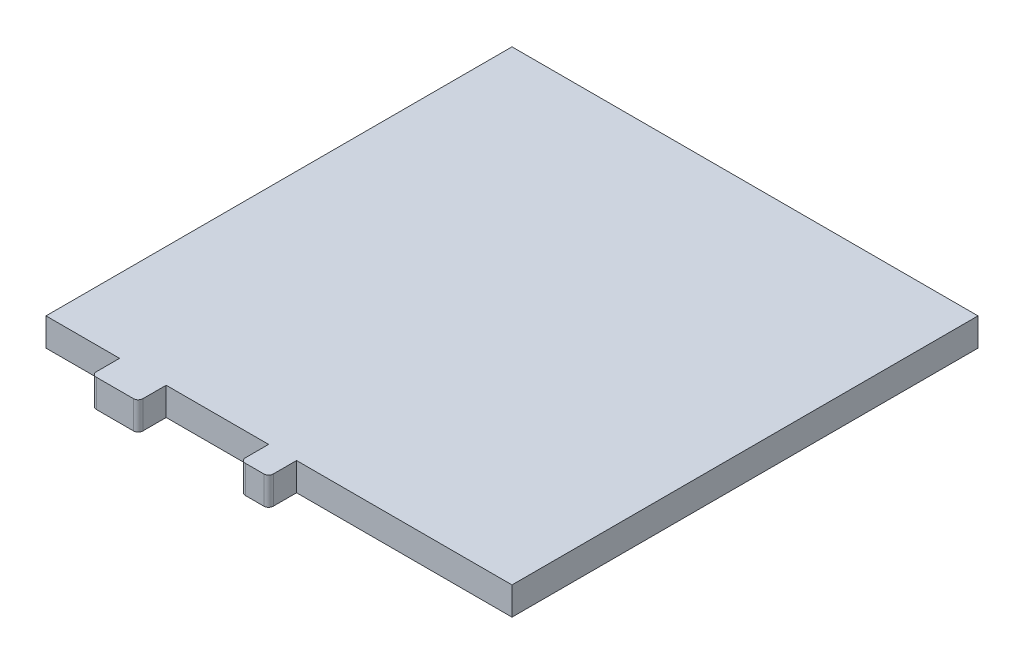
ISO-10303-21;
HEADER;
FILE_DESCRIPTION(('STEP AP214'),'2;1');
FILE_NAME('part.step','',(''),(''),'','','');
FILE_SCHEMA(('AUTOMOTIVE_DESIGN { 1 0 10303 214 1 1 1 1 }'));
ENDSEC;
DATA;
#1=APPLICATION_CONTEXT('core data for automotive mechanical design processes');
#2=APPLICATION_PROTOCOL_DEFINITION('international standard','automotive_design',2000,#1);
#3=PRODUCT_CONTEXT('',#1,'mechanical');
#4=PRODUCT('Part','Part','',(#3));
#5=PRODUCT_RELATED_PRODUCT_CATEGORY('part','',(#4));
#6=PRODUCT_DEFINITION_FORMATION('','',#4);
#7=PRODUCT_DEFINITION_CONTEXT('part definition',#1,'design');
#8=PRODUCT_DEFINITION('design','',#6,#7);
#9=PRODUCT_DEFINITION_SHAPE('','',#8);
#10=(LENGTH_UNIT() NAMED_UNIT(*) SI_UNIT(.MILLI.,.METRE.));
#11=(NAMED_UNIT(*) PLANE_ANGLE_UNIT() SI_UNIT($,.RADIAN.));
#12=(NAMED_UNIT(*) SI_UNIT($,.STERADIAN.) SOLID_ANGLE_UNIT());
#13=UNCERTAINTY_MEASURE_WITH_UNIT(LENGTH_MEASURE(1.E-05),#10,'distance_accuracy_value','');
#14=(GEOMETRIC_REPRESENTATION_CONTEXT(3) GLOBAL_UNCERTAINTY_ASSIGNED_CONTEXT((#13)) GLOBAL_UNIT_ASSIGNED_CONTEXT((#10,
#11,#12)) REPRESENTATION_CONTEXT('',''));
#15=CARTESIAN_POINT('',(0.,0.,0.));
#16=DIRECTION('',(0.,0.,1.));
#17=DIRECTION('',(1.,0.,0.));
#18=AXIS2_PLACEMENT_3D('',#15,#16,#17);
#19=CARTESIAN_POINT('',(-50.,6.,50.));
#20=DIRECTION('',(0.,0.,-1.));
#21=DIRECTION('',(-1.,0.,0.));
#22=AXIS2_PLACEMENT_3D('',#19,#20,#21);
#23=PLANE('',#22);
#24=DIRECTION('',(0.,-1.,0.));
#25=VECTOR('',#24,1.);
#26=CARTESIAN_POINT('',(-34.2132137689734,0.,50.));
#27=LINE('',#26,#25);
#28=CARTESIAN_POINT('',(-34.2132137689734,6.,50.));
#29=VERTEX_POINT('',#28);
#30=CARTESIAN_POINT('',(-34.2132137689734,0.,50.));
#31=VERTEX_POINT('',#30);
#32=EDGE_CURVE('E168',#29,#31,#27,.T.);
#33=ORIENTED_EDGE('',*,*,#32,.F.);
#34=DIRECTION('',(1.,0.,0.));
#35=VECTOR('',#34,1.);
#36=CARTESIAN_POINT('',(-50.,6.,50.));
#37=LINE('',#36,#35);
#38=CARTESIAN_POINT('',(-50.,6.,50.));
#39=VERTEX_POINT('',#38);
#40=EDGE_CURVE('E262',#39,#29,#37,.T.);
#41=ORIENTED_EDGE('',*,*,#40,.F.);
#42=DIRECTION('',(0.,-1.,0.));
#43=VECTOR('',#42,1.);
#44=CARTESIAN_POINT('',(-50.,6.,50.));
#45=LINE('',#44,#43);
#46=CARTESIAN_POINT('',(-50.,0.,50.));
#47=VERTEX_POINT('',#46);
#48=EDGE_CURVE('E255',#39,#47,#45,.T.);
#49=ORIENTED_EDGE('',*,*,#48,.T.);
#50=DIRECTION('',(1.,0.,0.));
#51=VECTOR('',#50,1.);
#52=CARTESIAN_POINT('',(-50.,0.,50.));
#53=LINE('',#52,#51);
#54=EDGE_CURVE('E161',#47,#31,#53,.T.);
#55=ORIENTED_EDGE('',*,*,#54,.T.);
#56=EDGE_LOOP('',(#33,#41,#49,#55));
#57=FACE_BOUND('',#56,.T.);
#58=ADVANCED_FACE('F33',(#57),#23,.F.);
#59=DIRECTION('',(0.,1.,0.));
#60=VECTOR('',#59,1.);
#61=CARTESIAN_POINT('',(-24.2132137689734,0.,50.));
#62=LINE('',#61,#60);
#63=CARTESIAN_POINT('',(-24.2132137689734,0.,50.));
#64=VERTEX_POINT('',#63);
#65=CARTESIAN_POINT('',(-24.2132137689734,6.,50.));
#66=VERTEX_POINT('',#65);
#67=EDGE_CURVE('E148',#64,#66,#62,.T.);
#68=ORIENTED_EDGE('',*,*,#67,.F.);
#69=CARTESIAN_POINT('',(-2.23222139220692,0.,50.));
#70=VERTEX_POINT('',#69);
#71=EDGE_CURVE('E154',#64,#70,#53,.T.);
#72=ORIENTED_EDGE('',*,*,#71,.T.);
#73=DIRECTION('',(0.,-1.,0.));
#74=VECTOR('',#73,1.);
#75=CARTESIAN_POINT('',(-2.23222139220692,5.99999999999999,50.));
#76=LINE('',#75,#74);
#77=CARTESIAN_POINT('',(-2.23222139220692,6.,50.));
#78=VERTEX_POINT('',#77);
#79=EDGE_CURVE('E186',#78,#70,#76,.T.);
#80=ORIENTED_EDGE('',*,*,#79,.F.);
#81=EDGE_CURVE('E166',#66,#78,#37,.T.);
#82=ORIENTED_EDGE('',*,*,#81,.F.);
#83=EDGE_LOOP('',(#68,#72,#80,#82));
#84=FACE_BOUND('',#83,.T.);
#85=ADVANCED_FACE('F165',(#84),#23,.F.);
#86=DIRECTION('',(0.,1.,0.));
#87=VECTOR('',#86,1.);
#88=CARTESIAN_POINT('',(3.76777860779308,5.99999999999999,50.));
#89=LINE('',#88,#87);
#90=CARTESIAN_POINT('',(3.76777860779309,0.,50.));
#91=VERTEX_POINT('',#90);
#92=CARTESIAN_POINT('',(3.76777860779309,6.,50.));
#93=VERTEX_POINT('',#92);
#94=EDGE_CURVE('E181',#91,#93,#89,.T.);
#95=ORIENTED_EDGE('',*,*,#94,.F.);
#96=CARTESIAN_POINT('',(50.,0.,50.));
#97=VERTEX_POINT('',#96);
#98=EDGE_CURVE('E162',#91,#97,#53,.T.);
#99=ORIENTED_EDGE('',*,*,#98,.T.);
#100=DIRECTION('',(0.,-1.,0.));
#101=VECTOR('',#100,1.);
#102=CARTESIAN_POINT('',(50.,6.,50.));
#103=LINE('',#102,#101);
#104=CARTESIAN_POINT('',(50.,6.,50.));
#105=VERTEX_POINT('',#104);
#106=EDGE_CURVE('E240',#105,#97,#103,.T.);
#107=ORIENTED_EDGE('',*,*,#106,.F.);
#108=EDGE_CURVE('E271',#93,#105,#37,.T.);
#109=ORIENTED_EDGE('',*,*,#108,.F.);
#110=EDGE_LOOP('',(#95,#99,#107,#109));
#111=FACE_BOUND('',#110,.T.);
#112=ADVANCED_FACE('F287',(#111),#23,.F.);
#113=CARTESIAN_POINT('',(50.,6.,-50.));
#114=DIRECTION('',(-1.,0.,0.));
#115=DIRECTION('',(0.,0.,1.));
#116=AXIS2_PLACEMENT_3D('',#113,#114,#115);
#117=PLANE('',#116);
#118=DIRECTION('',(0.,0.,-1.));
#119=VECTOR('',#118,1.);
#120=CARTESIAN_POINT('',(50.,0.,-50.));
#121=LINE('',#120,#119);
#122=CARTESIAN_POINT('',(50.,0.,-50.));
#123=VERTEX_POINT('',#122);
#124=EDGE_CURVE('E225',#97,#123,#121,.T.);
#125=ORIENTED_EDGE('',*,*,#124,.T.);
#126=DIRECTION('',(0.,-1.,0.));
#127=VECTOR('',#126,1.);
#128=CARTESIAN_POINT('',(50.,6.,-50.));
#129=LINE('',#128,#127);
#130=CARTESIAN_POINT('',(50.,6.,-50.));
#131=VERTEX_POINT('',#130);
#132=EDGE_CURVE('E250',#131,#123,#129,.T.);
#133=ORIENTED_EDGE('',*,*,#132,.F.);
#134=DIRECTION('',(0.,0.,-1.));
#135=VECTOR('',#134,1.);
#136=CARTESIAN_POINT('',(50.,6.,-50.));
#137=LINE('',#136,#135);
#138=EDGE_CURVE('E249',#105,#131,#137,.T.);
#139=ORIENTED_EDGE('',*,*,#138,.F.);
#140=ORIENTED_EDGE('',*,*,#106,.T.);
#141=EDGE_LOOP('',(#125,#133,#139,#140));
#142=FACE_BOUND('',#141,.T.);
#143=ADVANCED_FACE('F292',(#142),#117,.F.);
#144=CARTESIAN_POINT('',(-50.,6.,-50.));
#145=DIRECTION('',(0.,0.,1.));
#146=DIRECTION('',(1.,0.,0.));
#147=AXIS2_PLACEMENT_3D('',#144,#145,#146);
#148=PLANE('',#147);
#149=DIRECTION('',(-1.,0.,0.));
#150=VECTOR('',#149,1.);
#151=CARTESIAN_POINT('',(-50.,0.,-50.));
#152=LINE('',#151,#150);
#153=CARTESIAN_POINT('',(-50.,0.,-50.));
#154=VERTEX_POINT('',#153);
#155=EDGE_CURVE('E279',#123,#154,#152,.T.);
#156=ORIENTED_EDGE('',*,*,#155,.T.);
#157=DIRECTION('',(0.,-1.,0.));
#158=VECTOR('',#157,1.);
#159=CARTESIAN_POINT('',(-50.,6.,-50.));
#160=LINE('',#159,#158);
#161=CARTESIAN_POINT('',(-50.,6.,-50.));
#162=VERTEX_POINT('',#161);
#163=EDGE_CURVE('E253',#162,#154,#160,.T.);
#164=ORIENTED_EDGE('',*,*,#163,.F.);
#165=DIRECTION('',(-1.,0.,0.));
#166=VECTOR('',#165,1.);
#167=CARTESIAN_POINT('',(-50.,6.,-50.));
#168=LINE('',#167,#166);
#169=EDGE_CURVE('E295',#131,#162,#168,.T.);
#170=ORIENTED_EDGE('',*,*,#169,.F.);
#171=ORIENTED_EDGE('',*,*,#132,.T.);
#172=EDGE_LOOP('',(#156,#164,#170,#171));
#173=FACE_BOUND('',#172,.T.);
#174=ADVANCED_FACE('F294',(#173),#148,.F.);
#175=CARTESIAN_POINT('',(-50.,6.,-50.));
#176=DIRECTION('',(1.,0.,0.));
#177=DIRECTION('',(0.,0.,-1.));
#178=AXIS2_PLACEMENT_3D('',#175,#176,#177);
#179=PLANE('',#178);
#180=DIRECTION('',(0.,0.,1.));
#181=VECTOR('',#180,1.);
#182=CARTESIAN_POINT('',(-50.,0.,-50.));
#183=LINE('',#182,#181);
#184=EDGE_CURVE('E238',#154,#47,#183,.T.);
#185=ORIENTED_EDGE('',*,*,#184,.T.);
#186=ORIENTED_EDGE('',*,*,#48,.F.);
#187=DIRECTION('',(0.,0.,1.));
#188=VECTOR('',#187,1.);
#189=CARTESIAN_POINT('',(-50.,6.,-50.));
#190=LINE('',#189,#188);
#191=EDGE_CURVE('E275',#162,#39,#190,.T.);
#192=ORIENTED_EDGE('',*,*,#191,.F.);
#193=ORIENTED_EDGE('',*,*,#163,.T.);
#194=EDGE_LOOP('',(#185,#186,#192,#193));
#195=FACE_BOUND('',#194,.T.);
#196=ADVANCED_FACE('F300',(#195),#179,.F.);
#197=CARTESIAN_POINT('',(0.,6.,0.));
#198=DIRECTION('',(0.,1.,0.));
#199=DIRECTION('',(0.,0.,1.));
#200=AXIS2_PLACEMENT_3D('',#197,#198,#199);
#201=PLANE('',#200);
#202=DIRECTION('',(-1.,0.,0.));
#203=VECTOR('',#202,1.);
#204=CARTESIAN_POINT('',(-24.2132137689734,6.,56.));
#205=LINE('',#204,#203);
#206=CARTESIAN_POINT('',(-25.2132137689734,6.,56.));
#207=VERTEX_POINT('',#206);
#208=CARTESIAN_POINT('',(-33.2132137689734,6.,56.));
#209=VERTEX_POINT('',#208);
#210=EDGE_CURVE('E171',#207,#209,#205,.T.);
#211=ORIENTED_EDGE('',*,*,#210,.F.);
#212=CARTESIAN_POINT('',(-25.2132137689734,6.,55.));
#213=DIRECTION('',(0.,1.,0.));
#214=DIRECTION('',(0.,0.,1.));
#215=AXIS2_PLACEMENT_3D('',#212,#213,#214);
#216=CIRCLE('',#215,1.);
#217=CARTESIAN_POINT('',(-24.2132137689734,6.,55.));
#218=VERTEX_POINT('',#217);
#219=EDGE_CURVE('E311',#207,#218,#216,.T.);
#220=ORIENTED_EDGE('',*,*,#219,.T.);
#221=DIRECTION('',(0.,0.,-1.));
#222=VECTOR('',#221,1.);
#223=CARTESIAN_POINT('',(-24.2132137689734,6.,56.));
#224=LINE('',#223,#222);
#225=EDGE_CURVE('E151',#218,#66,#224,.T.);
#226=ORIENTED_EDGE('',*,*,#225,.T.);
#227=ORIENTED_EDGE('',*,*,#81,.T.);
#228=DIRECTION('',(0.,0.,-1.));
#229=VECTOR('',#228,1.);
#230=CARTESIAN_POINT('',(-2.23222139220692,5.99999999999999,56.));
#231=LINE('',#230,#229);
#232=CARTESIAN_POINT('',(-2.23222139220692,5.99999999999999,55.));
#233=VERTEX_POINT('',#232);
#234=EDGE_CURVE('E209',#233,#78,#231,.T.);
#235=ORIENTED_EDGE('',*,*,#234,.F.);
#236=CARTESIAN_POINT('',(-1.23222139220692,6.,55.));
#237=DIRECTION('',(0.,1.,0.));
#238=DIRECTION('',(0.,0.,1.));
#239=AXIS2_PLACEMENT_3D('',#236,#237,#238);
#240=CIRCLE('',#239,1.);
#241=CARTESIAN_POINT('',(-1.23222139220692,5.99999999999999,56.));
#242=VERTEX_POINT('',#241);
#243=EDGE_CURVE('E227',#233,#242,#240,.T.);
#244=ORIENTED_EDGE('',*,*,#243,.T.);
#245=DIRECTION('',(-1.,0.,0.));
#246=VECTOR('',#245,1.);
#247=CARTESIAN_POINT('',(-2.23222139220692,5.99999999999999,56.));
#248=LINE('',#247,#246);
#249=CARTESIAN_POINT('',(2.76777860779308,5.99999999999999,56.));
#250=VERTEX_POINT('',#249);
#251=EDGE_CURVE('E182',#250,#242,#248,.T.);
#252=ORIENTED_EDGE('',*,*,#251,.F.);
#253=CARTESIAN_POINT('',(2.76777860779308,6.,55.));
#254=DIRECTION('',(0.,1.,0.));
#255=DIRECTION('',(0.,0.,1.));
#256=AXIS2_PLACEMENT_3D('',#253,#254,#255);
#257=CIRCLE('',#256,1.);
#258=CARTESIAN_POINT('',(3.76777860779308,5.99999999999999,55.));
#259=VERTEX_POINT('',#258);
#260=EDGE_CURVE('E223',#250,#259,#257,.T.);
#261=ORIENTED_EDGE('',*,*,#260,.T.);
#262=DIRECTION('',(0.,0.,-1.));
#263=VECTOR('',#262,1.);
#264=CARTESIAN_POINT('',(3.76777860779308,5.99999999999999,56.));
#265=LINE('',#264,#263);
#266=EDGE_CURVE('E219',#259,#93,#265,.T.);
#267=ORIENTED_EDGE('',*,*,#266,.T.);
#268=ORIENTED_EDGE('',*,*,#108,.T.);
#269=ORIENTED_EDGE('',*,*,#138,.T.);
#270=ORIENTED_EDGE('',*,*,#169,.T.);
#271=ORIENTED_EDGE('',*,*,#191,.T.);
#272=ORIENTED_EDGE('',*,*,#40,.T.);
#273=DIRECTION('',(0.,0.,-1.));
#274=VECTOR('',#273,1.);
#275=CARTESIAN_POINT('',(-34.2132137689734,6.,56.));
#276=LINE('',#275,#274);
#277=CARTESIAN_POINT('',(-34.2132137689734,6.,55.));
#278=VERTEX_POINT('',#277);
#279=EDGE_CURVE('E177',#278,#29,#276,.T.);
#280=ORIENTED_EDGE('',*,*,#279,.F.);
#281=CARTESIAN_POINT('',(-33.2132137689734,6.,55.));
#282=DIRECTION('',(0.,1.,0.));
#283=DIRECTION('',(0.,0.,1.));
#284=AXIS2_PLACEMENT_3D('',#281,#282,#283);
#285=CIRCLE('',#284,1.);
#286=EDGE_CURVE('E306',#278,#209,#285,.T.);
#287=ORIENTED_EDGE('',*,*,#286,.T.);
#288=EDGE_LOOP('',(#211,#220,#226,#227,#235,#244,#252,#261,#267,#268,#269,#270,#271,#272,#280,#287));
#289=FACE_BOUND('',#288,.T.);
#290=ADVANCED_FACE('F298',(#289),#201,.T.);
#291=CARTESIAN_POINT('',(0.,0.,0.));
#292=DIRECTION('',(0.,1.,0.));
#293=DIRECTION('',(0.,0.,1.));
#294=AXIS2_PLACEMENT_3D('',#291,#292,#293);
#295=PLANE('',#294);
#296=DIRECTION('',(0.,0.,-1.));
#297=VECTOR('',#296,1.);
#298=CARTESIAN_POINT('',(-24.2132137689734,0.,56.));
#299=LINE('',#298,#297);
#300=CARTESIAN_POINT('',(-24.2132137689734,0.,55.));
#301=VERTEX_POINT('',#300);
#302=EDGE_CURVE('E144',#301,#64,#299,.T.);
#303=ORIENTED_EDGE('',*,*,#302,.F.);
#304=CARTESIAN_POINT('',(-25.2132137689734,0.,55.));
#305=DIRECTION('',(0.,1.,0.));
#306=DIRECTION('',(0.,0.,1.));
#307=AXIS2_PLACEMENT_3D('',#304,#305,#306);
#308=CIRCLE('',#307,1.);
#309=CARTESIAN_POINT('',(-25.2132137689734,0.,56.));
#310=VERTEX_POINT('',#309);
#311=EDGE_CURVE('E41',#301,#310,#308,.F.);
#312=ORIENTED_EDGE('',*,*,#311,.T.);
#313=DIRECTION('',(1.,0.,0.));
#314=VECTOR('',#313,1.);
#315=CARTESIAN_POINT('',(-24.2132137689734,0.,56.));
#316=LINE('',#315,#314);
#317=CARTESIAN_POINT('',(-33.2132137689734,0.,56.));
#318=VERTEX_POINT('',#317);
#319=EDGE_CURVE('E167',#318,#310,#316,.T.);
#320=ORIENTED_EDGE('',*,*,#319,.F.);
#321=CARTESIAN_POINT('',(-33.2132137689734,0.,55.));
#322=DIRECTION('',(0.,1.,0.));
#323=DIRECTION('',(0.,0.,1.));
#324=AXIS2_PLACEMENT_3D('',#321,#322,#323);
#325=CIRCLE('',#324,1.);
#326=CARTESIAN_POINT('',(-34.2132137689734,0.,55.));
#327=VERTEX_POINT('',#326);
#328=EDGE_CURVE('E48',#318,#327,#325,.F.);
#329=ORIENTED_EDGE('',*,*,#328,.T.);
#330=DIRECTION('',(0.,0.,-1.));
#331=VECTOR('',#330,1.);
#332=CARTESIAN_POINT('',(-34.2132137689734,0.,56.));
#333=LINE('',#332,#331);
#334=EDGE_CURVE('E150',#327,#31,#333,.T.);
#335=ORIENTED_EDGE('',*,*,#334,.T.);
#336=ORIENTED_EDGE('',*,*,#54,.F.);
#337=ORIENTED_EDGE('',*,*,#184,.F.);
#338=ORIENTED_EDGE('',*,*,#155,.F.);
#339=ORIENTED_EDGE('',*,*,#124,.F.);
#340=ORIENTED_EDGE('',*,*,#98,.F.);
#341=DIRECTION('',(0.,0.,-1.));
#342=VECTOR('',#341,1.);
#343=CARTESIAN_POINT('',(3.76777860779308,0.,56.));
#344=LINE('',#343,#342);
#345=CARTESIAN_POINT('',(3.76777860779308,0.,55.));
#346=VERTEX_POINT('',#345);
#347=EDGE_CURVE('E189',#346,#91,#344,.T.);
#348=ORIENTED_EDGE('',*,*,#347,.F.);
#349=CARTESIAN_POINT('',(2.76777860779308,0.,55.));
#350=DIRECTION('',(0.,1.,0.));
#351=DIRECTION('',(0.,0.,1.));
#352=AXIS2_PLACEMENT_3D('',#349,#350,#351);
#353=CIRCLE('',#352,1.);
#354=CARTESIAN_POINT('',(2.76777860779308,0.,56.));
#355=VERTEX_POINT('',#354);
#356=EDGE_CURVE('E210',#346,#355,#353,.F.);
#357=ORIENTED_EDGE('',*,*,#356,.T.);
#358=DIRECTION('',(1.,0.,0.));
#359=VECTOR('',#358,1.);
#360=CARTESIAN_POINT('',(-2.23222139220692,0.,56.));
#361=LINE('',#360,#359);
#362=CARTESIAN_POINT('',(-1.23222139220692,0.,56.));
#363=VERTEX_POINT('',#362);
#364=EDGE_CURVE('E185',#363,#355,#361,.T.);
#365=ORIENTED_EDGE('',*,*,#364,.F.);
#366=CARTESIAN_POINT('',(-1.23222139220692,0.,55.));
#367=DIRECTION('',(0.,1.,0.));
#368=DIRECTION('',(0.,0.,1.));
#369=AXIS2_PLACEMENT_3D('',#366,#367,#368);
#370=CIRCLE('',#369,1.);
#371=CARTESIAN_POINT('',(-2.23222139220692,0.,55.));
#372=VERTEX_POINT('',#371);
#373=EDGE_CURVE('E220',#363,#372,#370,.F.);
#374=ORIENTED_EDGE('',*,*,#373,.T.);
#375=DIRECTION('',(0.,0.,-1.));
#376=VECTOR('',#375,1.);
#377=CARTESIAN_POINT('',(-2.23222139220692,0.,56.));
#378=LINE('',#377,#376);
#379=EDGE_CURVE('E157',#372,#70,#378,.T.);
#380=ORIENTED_EDGE('',*,*,#379,.T.);
#381=ORIENTED_EDGE('',*,*,#71,.F.);
#382=EDGE_LOOP('',(#303,#312,#320,#329,#335,#336,#337,#338,#339,#340,#348,#357,#365,#374,#380,#381));
#383=FACE_BOUND('',#382,.T.);
#384=ADVANCED_FACE('F155',(#383),#295,.F.);
#385=CARTESIAN_POINT('',(3.76777860779308,5.99999999999999,56.));
#386=DIRECTION('',(-1.,0.,0.));
#387=DIRECTION('',(0.,-1.,0.));
#388=AXIS2_PLACEMENT_3D('',#385,#386,#387);
#389=PLANE('',#388);
#390=ORIENTED_EDGE('',*,*,#266,.F.);
#391=DIRECTION('',(0.,1.,0.));
#392=VECTOR('',#391,1.);
#393=CARTESIAN_POINT('',(3.76777860779308,0.,55.));
#394=LINE('',#393,#392);
#395=EDGE_CURVE('E229',#259,#346,#394,.F.);
#396=ORIENTED_EDGE('',*,*,#395,.T.);
#397=ORIENTED_EDGE('',*,*,#347,.T.);
#398=ORIENTED_EDGE('',*,*,#94,.T.);
#399=EDGE_LOOP('',(#390,#396,#397,#398));
#400=FACE_BOUND('',#399,.T.);
#401=ADVANCED_FACE('F343',(#400),#389,.F.);
#402=CARTESIAN_POINT('',(-2.23222139220692,5.99999999999999,56.));
#403=DIRECTION('',(1.,0.,0.));
#404=DIRECTION('',(0.,1.,0.));
#405=AXIS2_PLACEMENT_3D('',#402,#403,#404);
#406=PLANE('',#405);
#407=ORIENTED_EDGE('',*,*,#379,.F.);
#408=DIRECTION('',(0.,-1.,0.));
#409=VECTOR('',#408,1.);
#410=CARTESIAN_POINT('',(-2.23222139220692,5.99999999999999,55.));
#411=LINE('',#410,#409);
#412=EDGE_CURVE('E221',#372,#233,#411,.F.);
#413=ORIENTED_EDGE('',*,*,#412,.T.);
#414=ORIENTED_EDGE('',*,*,#234,.T.);
#415=ORIENTED_EDGE('',*,*,#79,.T.);
#416=EDGE_LOOP('',(#407,#413,#414,#415));
#417=FACE_BOUND('',#416,.T.);
#418=ADVANCED_FACE('F327',(#417),#406,.F.);
#419=CARTESIAN_POINT('',(0.,0.,56.));
#420=DIRECTION('',(0.,0.,1.));
#421=DIRECTION('',(1.,0.,0.));
#422=AXIS2_PLACEMENT_3D('',#419,#420,#421);
#423=PLANE('',#422);
#424=ORIENTED_EDGE('',*,*,#251,.T.);
#425=DIRECTION('',(0.,-1.,0.));
#426=VECTOR('',#425,1.);
#427=CARTESIAN_POINT('',(-1.23222139220692,0.,56.));
#428=LINE('',#427,#426);
#429=EDGE_CURVE('E206',#242,#363,#428,.T.);
#430=ORIENTED_EDGE('',*,*,#429,.T.);
#431=ORIENTED_EDGE('',*,*,#364,.T.);
#432=DIRECTION('',(0.,1.,0.));
#433=VECTOR('',#432,1.);
#434=CARTESIAN_POINT('',(2.76777860779308,5.99999999999999,56.));
#435=LINE('',#434,#433);
#436=EDGE_CURVE('E202',#355,#250,#435,.T.);
#437=ORIENTED_EDGE('',*,*,#436,.T.);
#438=EDGE_LOOP('',(#424,#430,#431,#437));
#439=FACE_BOUND('',#438,.T.);
#440=ADVANCED_FACE('F336',(#439),#423,.T.);
#441=CARTESIAN_POINT('',(-1.23222139220692,0.,55.));
#442=DIRECTION('',(0.,1.,0.));
#443=DIRECTION('',(-1.,0.,0.));
#444=AXIS2_PLACEMENT_3D('',#441,#442,#443);
#445=CYLINDRICAL_SURFACE('',#444,1.);
#446=ORIENTED_EDGE('',*,*,#243,.F.);
#447=ORIENTED_EDGE('',*,*,#412,.F.);
#448=ORIENTED_EDGE('',*,*,#373,.F.);
#449=ORIENTED_EDGE('',*,*,#429,.F.);
#450=EDGE_LOOP('',(#446,#447,#448,#449));
#451=FACE_BOUND('',#450,.T.);
#452=ADVANCED_FACE('F330',(#451),#445,.T.);
#453=CARTESIAN_POINT('',(2.76777860779308,0.,55.));
#454=DIRECTION('',(0.,-1.,0.));
#455=DIRECTION('',(1.,0.,0.));
#456=AXIS2_PLACEMENT_3D('',#453,#454,#455);
#457=CYLINDRICAL_SURFACE('',#456,1.);
#458=ORIENTED_EDGE('',*,*,#356,.F.);
#459=ORIENTED_EDGE('',*,*,#395,.F.);
#460=ORIENTED_EDGE('',*,*,#260,.F.);
#461=ORIENTED_EDGE('',*,*,#436,.F.);
#462=EDGE_LOOP('',(#458,#459,#460,#461));
#463=FACE_BOUND('',#462,.T.);
#464=ADVANCED_FACE('F341',(#463),#457,.T.);
#465=CARTESIAN_POINT('',(-34.2132137689734,0.,56.));
#466=DIRECTION('',(1.,0.,0.));
#467=DIRECTION('',(0.,1.,0.));
#468=AXIS2_PLACEMENT_3D('',#465,#466,#467);
#469=PLANE('',#468);
#470=ORIENTED_EDGE('',*,*,#334,.F.);
#471=DIRECTION('',(0.,-1.,0.));
#472=VECTOR('',#471,1.);
#473=CARTESIAN_POINT('',(-34.2132137689734,6.,55.));
#474=LINE('',#473,#472);
#475=EDGE_CURVE('E11',#327,#278,#474,.F.);
#476=ORIENTED_EDGE('',*,*,#475,.T.);
#477=ORIENTED_EDGE('',*,*,#279,.T.);
#478=ORIENTED_EDGE('',*,*,#32,.T.);
#479=EDGE_LOOP('',(#470,#476,#477,#478));
#480=FACE_BOUND('',#479,.T.);
#481=ADVANCED_FACE('F303',(#480),#469,.F.);
#482=CARTESIAN_POINT('',(-24.2132137689734,0.,56.));
#483=DIRECTION('',(-1.,0.,0.));
#484=DIRECTION('',(0.,-1.,0.));
#485=AXIS2_PLACEMENT_3D('',#482,#483,#484);
#486=PLANE('',#485);
#487=ORIENTED_EDGE('',*,*,#225,.F.);
#488=DIRECTION('',(0.,1.,0.));
#489=VECTOR('',#488,1.);
#490=CARTESIAN_POINT('',(-24.2132137689734,0.,55.));
#491=LINE('',#490,#489);
#492=EDGE_CURVE('E56',#218,#301,#491,.F.);
#493=ORIENTED_EDGE('',*,*,#492,.T.);
#494=ORIENTED_EDGE('',*,*,#302,.T.);
#495=ORIENTED_EDGE('',*,*,#67,.T.);
#496=EDGE_LOOP('',(#487,#493,#494,#495));
#497=FACE_BOUND('',#496,.T.);
#498=ADVANCED_FACE('F146',(#497),#486,.F.);
#499=CARTESIAN_POINT('',(0.,0.,56.));
#500=DIRECTION('',(0.,0.,1.));
#501=DIRECTION('',(1.,0.,0.));
#502=AXIS2_PLACEMENT_3D('',#499,#500,#501);
#503=PLANE('',#502);
#504=ORIENTED_EDGE('',*,*,#319,.T.);
#505=DIRECTION('',(0.,1.,0.));
#506=VECTOR('',#505,1.);
#507=CARTESIAN_POINT('',(-25.2132137689734,6.,56.));
#508=LINE('',#507,#506);
#509=EDGE_CURVE('E312',#310,#207,#508,.T.);
#510=ORIENTED_EDGE('',*,*,#509,.T.);
#511=ORIENTED_EDGE('',*,*,#210,.T.);
#512=DIRECTION('',(0.,-1.,0.));
#513=VECTOR('',#512,1.);
#514=CARTESIAN_POINT('',(-33.2132137689734,0.,56.));
#515=LINE('',#514,#513);
#516=EDGE_CURVE('E230',#209,#318,#515,.T.);
#517=ORIENTED_EDGE('',*,*,#516,.T.);
#518=EDGE_LOOP('',(#504,#510,#511,#517));
#519=FACE_BOUND('',#518,.T.);
#520=ADVANCED_FACE('F322',(#519),#503,.T.);
#521=CARTESIAN_POINT('',(-25.2132137689734,0.,55.));
#522=DIRECTION('',(0.,-1.,0.));
#523=DIRECTION('',(1.,0.,0.));
#524=AXIS2_PLACEMENT_3D('',#521,#522,#523);
#525=CYLINDRICAL_SURFACE('',#524,1.);
#526=ORIENTED_EDGE('',*,*,#311,.F.);
#527=ORIENTED_EDGE('',*,*,#492,.F.);
#528=ORIENTED_EDGE('',*,*,#219,.F.);
#529=ORIENTED_EDGE('',*,*,#509,.F.);
#530=EDGE_LOOP('',(#526,#527,#528,#529));
#531=FACE_BOUND('',#530,.T.);
#532=ADVANCED_FACE('F323',(#531),#525,.T.);
#533=CARTESIAN_POINT('',(-33.2132137689734,0.,55.));
#534=DIRECTION('',(0.,1.,0.));
#535=DIRECTION('',(-1.,0.,0.));
#536=AXIS2_PLACEMENT_3D('',#533,#534,#535);
#537=CYLINDRICAL_SURFACE('',#536,1.);
#538=ORIENTED_EDGE('',*,*,#286,.F.);
#539=ORIENTED_EDGE('',*,*,#475,.F.);
#540=ORIENTED_EDGE('',*,*,#328,.F.);
#541=ORIENTED_EDGE('',*,*,#516,.F.);
#542=EDGE_LOOP('',(#538,#539,#540,#541));
#543=FACE_BOUND('',#542,.T.);
#544=ADVANCED_FACE('F35',(#543),#537,.T.);
#545=CLOSED_SHELL('',(#58,#85,#112,#143,#174,#196,#290,#384,#401,#418,#440,#452,#464,#481,#498,
#520,#532,#544));
#546=MANIFOLD_SOLID_BREP('B2',#545);
#547=ADVANCED_BREP_SHAPE_REPRESENTATION('',(#18,#546),#14);
#548=SHAPE_DEFINITION_REPRESENTATION(#9,#547);
ENDSEC;
END-ISO-10303-21;
